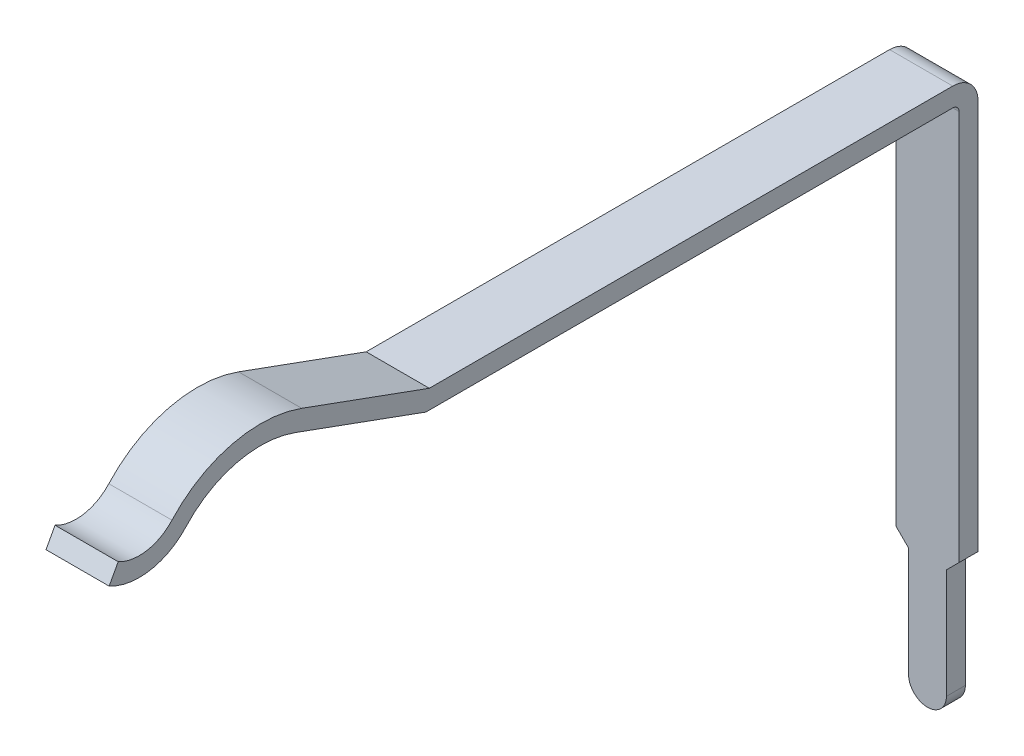
ISO-10303-21;
HEADER;
FILE_DESCRIPTION(('STEP AP214'),'2;1');
FILE_NAME('part.step','',(''),(''),'','','');
FILE_SCHEMA(('AUTOMOTIVE_DESIGN { 1 0 10303 214 1 1 1 1 }'));
ENDSEC;
DATA;
#1=APPLICATION_CONTEXT('core data for automotive mechanical design processes');
#2=APPLICATION_PROTOCOL_DEFINITION('international standard','automotive_design',2000,#1);
#3=PRODUCT_CONTEXT('',#1,'mechanical');
#4=PRODUCT('Part','Part','',(#3));
#5=PRODUCT_RELATED_PRODUCT_CATEGORY('part','',(#4));
#6=PRODUCT_DEFINITION_FORMATION('','',#4);
#7=PRODUCT_DEFINITION_CONTEXT('part definition',#1,'design');
#8=PRODUCT_DEFINITION('design','',#6,#7);
#9=PRODUCT_DEFINITION_SHAPE('','',#8);
#10=(LENGTH_UNIT() NAMED_UNIT(*) SI_UNIT(.MILLI.,.METRE.));
#11=(NAMED_UNIT(*) PLANE_ANGLE_UNIT() SI_UNIT($,.RADIAN.));
#12=(NAMED_UNIT(*) SI_UNIT($,.STERADIAN.) SOLID_ANGLE_UNIT());
#13=UNCERTAINTY_MEASURE_WITH_UNIT(LENGTH_MEASURE(1.E-05),#10,'distance_accuracy_value','');
#14=(GEOMETRIC_REPRESENTATION_CONTEXT(3) GLOBAL_UNCERTAINTY_ASSIGNED_CONTEXT((#13)) GLOBAL_UNIT_ASSIGNED_CONTEXT((#10,
#11,#12)) REPRESENTATION_CONTEXT('',''));
#15=CARTESIAN_POINT('',(0.,0.,0.));
#16=DIRECTION('',(0.,0.,1.));
#17=DIRECTION('',(1.,0.,0.));
#18=AXIS2_PLACEMENT_3D('',#15,#16,#17);
#19=CARTESIAN_POINT('',(0.5,-0.1,-14.36));
#20=DIRECTION('',(-1.,0.,0.));
#21=DIRECTION('',(0.,0.,1.));
#22=AXIS2_PLACEMENT_3D('',#19,#20,#21);
#23=CYLINDRICAL_SURFACE('',#22,0.399999999999999);
#24=DIRECTION('',(-1.,0.,0.));
#25=VECTOR('',#24,1.);
#26=CARTESIAN_POINT('',(0.,0.3,-14.36));
#27=LINE('',#26,#25);
#28=CARTESIAN_POINT('',(0.5,0.300000000311152,-14.36));
#29=VERTEX_POINT('',#28);
#30=CARTESIAN_POINT('',(-0.5,0.300000000311152,-14.36));
#31=VERTEX_POINT('',#30);
#32=EDGE_CURVE('E201',#29,#31,#27,.T.);
#33=ORIENTED_EDGE('',*,*,#32,.F.);
#34=CARTESIAN_POINT('',(0.5,-0.1,-14.36));
#35=DIRECTION('',(-1.,0.,0.));
#36=DIRECTION('',(0.,0.,1.));
#37=AXIS2_PLACEMENT_3D('',#34,#35,#36);
#38=CIRCLE('',#37,0.399999999999999);
#39=CARTESIAN_POINT('',(0.5,-0.1,-14.76));
#40=VERTEX_POINT('',#39);
#41=EDGE_CURVE('E238',#40,#29,#38,.F.);
#42=ORIENTED_EDGE('',*,*,#41,.F.);
#43=DIRECTION('',(1.,0.,0.));
#44=VECTOR('',#43,1.);
#45=CARTESIAN_POINT('',(0.,-0.1,-14.76));
#46=LINE('',#45,#44);
#47=CARTESIAN_POINT('',(-0.5,-0.1,-14.76));
#48=VERTEX_POINT('',#47);
#49=EDGE_CURVE('E152',#48,#40,#46,.T.);
#50=ORIENTED_EDGE('',*,*,#49,.F.);
#51=CARTESIAN_POINT('',(-0.5,-0.1,-14.36));
#52=DIRECTION('',(-1.,0.,0.));
#53=DIRECTION('',(0.,0.,1.));
#54=AXIS2_PLACEMENT_3D('',#51,#52,#53);
#55=CIRCLE('',#54,0.399999999999999);
#56=EDGE_CURVE('E206',#48,#31,#55,.F.);
#57=ORIENTED_EDGE('',*,*,#56,.T.);
#58=EDGE_LOOP('',(#33,#42,#50,#57));
#59=FACE_BOUND('',#58,.T.);
#60=ADVANCED_FACE('F17',(#59),#23,.T.);
#61=CARTESIAN_POINT('',(-0.5,0.3,-14.36));
#62=DIRECTION('',(0.,1.,0.));
#63=DIRECTION('',(0.,0.,1.));
#64=AXIS2_PLACEMENT_3D('',#61,#62,#63);
#65=PLANE('',#64);
#66=DIRECTION('',(0.,0.,1.));
#67=VECTOR('',#66,1.);
#68=CARTESIAN_POINT('',(0.5,0.300000000622303,-7.83872));
#69=LINE('',#68,#67);
#70=CARTESIAN_POINT('',(0.5,0.300000000466727,-6.07037707311936));
#71=VERTEX_POINT('',#70);
#72=EDGE_CURVE('E237',#29,#71,#69,.T.);
#73=ORIENTED_EDGE('',*,*,#72,.F.);
#74=ORIENTED_EDGE('',*,*,#32,.T.);
#75=DIRECTION('',(0.,0.,1.));
#76=VECTOR('',#75,1.);
#77=CARTESIAN_POINT('',(-0.5,0.300000000622303,-7.83872));
#78=LINE('',#77,#76);
#79=CARTESIAN_POINT('',(-0.5,0.300000000311152,-6.07037706914512));
#80=VERTEX_POINT('',#79);
#81=EDGE_CURVE('E263',#31,#80,#78,.T.);
#82=ORIENTED_EDGE('',*,*,#81,.T.);
#83=DIRECTION('',(-1.,0.,0.));
#84=VECTOR('',#83,1.);
#85=CARTESIAN_POINT('',(0.,0.3,-6.07037707));
#86=LINE('',#85,#84);
#87=EDGE_CURVE('E199',#71,#80,#86,.T.);
#88=ORIENTED_EDGE('',*,*,#87,.F.);
#89=EDGE_LOOP('',(#73,#74,#82,#88));
#90=FACE_BOUND('',#89,.T.);
#91=ADVANCED_FACE('F368',(#90),#65,.T.);
#92=CARTESIAN_POINT('',(-0.5,0.3,-6.07037707));
#93=DIRECTION('',(0.,0.939692620883365,-0.342020143057909));
#94=DIRECTION('',(0.,0.342020143057909,0.939692620883365));
#95=AXIS2_PLACEMENT_3D('',#92,#93,#94);
#96=PLANE('',#95);
#97=DIRECTION('',(0.,0.342020140746785,0.939692621724545));
#98=VECTOR('',#97,1.);
#99=CARTESIAN_POINT('',(0.5,0.300000000622303,-6.07037707623872));
#100=LINE('',#99,#98);
#101=CARTESIAN_POINT('',(0.5,1.03541597897149,-4.04983826915849));
#102=VERTEX_POINT('',#101);
#103=EDGE_CURVE('E235',#71,#102,#100,.T.);
#104=ORIENTED_EDGE('',*,*,#103,.F.);
#105=ORIENTED_EDGE('',*,*,#87,.T.);
#106=DIRECTION('',(0.,0.342020143057909,0.939692620883365));
#107=VECTOR('',#106,1.);
#108=CARTESIAN_POINT('',(-0.5,0.3,-6.07037707));
#109=LINE('',#108,#107);
#110=CARTESIAN_POINT('',(-0.5,1.03541597937978,-4.04983827179352));
#111=VERTEX_POINT('',#110);
#112=EDGE_CURVE('E261',#80,#111,#109,.T.);
#113=ORIENTED_EDGE('',*,*,#112,.T.);
#114=DIRECTION('',(-1.,0.,0.));
#115=VECTOR('',#114,1.);
#116=CARTESIAN_POINT('',(0.,1.03541597961914,-4.04983827197282));
#117=LINE('',#116,#115);
#118=EDGE_CURVE('E196',#111,#102,#117,.F.);
#119=ORIENTED_EDGE('',*,*,#118,.T.);
#120=EDGE_LOOP('',(#104,#105,#113,#119));
#121=FACE_BOUND('',#120,.T.);
#122=ADVANCED_FACE('F364',(#121),#96,.T.);
#123=CARTESIAN_POINT('',(0.5,-0.75,-3.4));
#124=DIRECTION('',(-1.,0.,0.));
#125=DIRECTION('',(0.,0.,1.));
#126=AXIS2_PLACEMENT_3D('',#123,#124,#125);
#127=CYLINDRICAL_SURFACE('',#126,1.9);
#128=DIRECTION('',(1.,0.,0.));
#129=VECTOR('',#128,1.);
#130=CARTESIAN_POINT('',(0.,0.52884615384742,-1.99481228515964));
#131=LINE('',#130,#129);
#132=CARTESIAN_POINT('',(0.5,0.528846153901887,-1.99481228505774));
#133=VERTEX_POINT('',#132);
#134=CARTESIAN_POINT('',(-0.5,0.528846153826487,-1.99481228514059));
#135=VERTEX_POINT('',#134);
#136=EDGE_CURVE('E194',#133,#135,#131,.F.);
#137=ORIENTED_EDGE('',*,*,#136,.F.);
#138=CARTESIAN_POINT('',(0.5,-0.75,-3.4));
#139=DIRECTION('',(-1.,0.,0.));
#140=DIRECTION('',(0.,0.,1.));
#141=AXIS2_PLACEMENT_3D('',#138,#139,#140);
#142=CIRCLE('',#141,1.9);
#143=EDGE_CURVE('E233',#102,#133,#142,.F.);
#144=ORIENTED_EDGE('',*,*,#143,.F.);
#145=ORIENTED_EDGE('',*,*,#118,.F.);
#146=CARTESIAN_POINT('',(-0.5,-0.75,-3.4));
#147=DIRECTION('',(-1.,0.,0.));
#148=DIRECTION('',(0.,0.,1.));
#149=AXIS2_PLACEMENT_3D('',#146,#147,#148);
#150=CIRCLE('',#149,1.9);
#151=EDGE_CURVE('E258',#111,#135,#150,.F.);
#152=ORIENTED_EDGE('',*,*,#151,.T.);
#153=EDGE_LOOP('',(#137,#144,#145,#152));
#154=FACE_BOUND('',#153,.T.);
#155=ADVANCED_FACE('F367',(#154),#127,.T.);
#156=CARTESIAN_POINT('',(0.5,1.,-1.477111548));
#157=DIRECTION('',(-1.,0.,0.));
#158=DIRECTION('',(0.,0.,1.));
#159=AXIS2_PLACEMENT_3D('',#156,#157,#158);
#160=CYLINDRICAL_SURFACE('',#159,0.7);
#161=CARTESIAN_POINT('',(0.5,1.,-1.477111548));
#162=DIRECTION('',(-1.,0.,0.));
#163=DIRECTION('',(0.,0.,1.));
#164=AXIS2_PLACEMENT_3D('',#161,#162,#163);
#165=CIRCLE('',#164,0.7);
#166=CARTESIAN_POINT('',(0.5,0.38481007960968,-1.14313346157592));
#167=VERTEX_POINT('',#166);
#168=EDGE_CURVE('E231',#133,#167,#165,.T.);
#169=ORIENTED_EDGE('',*,*,#168,.F.);
#170=ORIENTED_EDGE('',*,*,#136,.T.);
#171=CARTESIAN_POINT('',(-0.5,1.,-1.477111548));
#172=DIRECTION('',(-1.,0.,0.));
#173=DIRECTION('',(0.,0.,1.));
#174=AXIS2_PLACEMENT_3D('',#171,#172,#173);
#175=CIRCLE('',#174,0.7);
#176=CARTESIAN_POINT('',(-0.5,0.384810078226828,-1.14313346412314));
#177=VERTEX_POINT('',#176);
#178=EDGE_CURVE('E255',#135,#177,#175,.T.);
#179=ORIENTED_EDGE('',*,*,#178,.T.);
#180=DIRECTION('',(-1.,0.,0.));
#181=VECTOR('',#180,1.);
#182=CARTESIAN_POINT('',(0.,0.384810078,-1.143133464));
#183=LINE('',#182,#181);
#184=EDGE_CURVE('E192',#167,#177,#183,.T.);
#185=ORIENTED_EDGE('',*,*,#184,.F.);
#186=EDGE_LOOP('',(#169,#170,#179,#185));
#187=FACE_BOUND('',#186,.T.);
#188=ADVANCED_FACE('F362',(#187),#160,.F.);
#189=CARTESIAN_POINT('',(-0.5,0.384810078,-1.143133464));
#190=DIRECTION('',(0.,0.477111547746772,0.878842745322893));
#191=DIRECTION('',(0.,-0.878842745322893,0.477111547746772));
#192=AXIS2_PLACEMENT_3D('',#189,#190,#191);
#193=PLANE('',#192);
#194=DIRECTION('',(0.,-0.878842757719991,0.477111524911232));
#195=VECTOR('',#194,1.);
#196=CARTESIAN_POINT('',(0.5,0.384810080288333,-1.1431334586464));
#197=LINE('',#196,#195);
#198=CARTESIAN_POINT('',(0.5,0.121157254244879,-1.00000000104939));
#199=VERTEX_POINT('',#198);
#200=EDGE_CURVE('E229',#167,#199,#197,.T.);
#201=ORIENTED_EDGE('',*,*,#200,.F.);
#202=ORIENTED_EDGE('',*,*,#184,.T.);
#203=DIRECTION('',(0.,-0.878842745322893,0.477111547746772));
#204=VECTOR('',#203,1.);
#205=CARTESIAN_POINT('',(-0.5,0.384810078,-1.143133464));
#206=LINE('',#205,#204);
#207=CARTESIAN_POINT('',(-0.5,0.121157254721593,-1.00000000017128));
#208=VERTEX_POINT('',#207);
#209=EDGE_CURVE('E252',#177,#208,#206,.T.);
#210=ORIENTED_EDGE('',*,*,#209,.T.);
#211=DIRECTION('',(-1.,0.,0.));
#212=VECTOR('',#211,1.);
#213=CARTESIAN_POINT('',(0.,0.121157254586397,-1.00000000042032));
#214=LINE('',#213,#212);
#215=EDGE_CURVE('E189',#208,#199,#214,.F.);
#216=ORIENTED_EDGE('',*,*,#215,.T.);
#217=EDGE_LOOP('',(#201,#202,#210,#216));
#218=FACE_BOUND('',#217,.T.);
#219=ADVANCED_FACE('F358',(#218),#193,.T.);
#220=CARTESIAN_POINT('',(0.5,1.,-1.477111548));
#221=DIRECTION('',(-1.,0.,0.));
#222=DIRECTION('',(0.,0.,1.));
#223=AXIS2_PLACEMENT_3D('',#220,#221,#222);
#224=CYLINDRICAL_SURFACE('',#223,1.);
#225=DIRECTION('',(1.,0.,0.));
#226=VECTOR('',#225,1.);
#227=CARTESIAN_POINT('',(0.,0.326923076434778,-2.21668402890764));
#228=LINE('',#227,#226);
#229=CARTESIAN_POINT('',(0.5,0.326923076649927,-2.21668402925492));
#230=VERTEX_POINT('',#229);
#231=CARTESIAN_POINT('',(-0.5,0.326923076725328,-2.21668402917207));
#232=VERTEX_POINT('',#231);
#233=EDGE_CURVE('E187',#230,#232,#228,.F.);
#234=ORIENTED_EDGE('',*,*,#233,.F.);
#235=CARTESIAN_POINT('',(0.5,1.,-1.477111548));
#236=DIRECTION('',(-1.,0.,0.));
#237=DIRECTION('',(0.,0.,1.));
#238=AXIS2_PLACEMENT_3D('',#235,#236,#237);
#239=CIRCLE('',#238,1.);
#240=EDGE_CURVE('E227',#199,#230,#239,.F.);
#241=ORIENTED_EDGE('',*,*,#240,.F.);
#242=ORIENTED_EDGE('',*,*,#215,.F.);
#243=CARTESIAN_POINT('',(-0.5,1.,-1.477111548));
#244=DIRECTION('',(-1.,0.,0.));
#245=DIRECTION('',(0.,0.,1.));
#246=AXIS2_PLACEMENT_3D('',#243,#244,#245);
#247=CIRCLE('',#246,1.);
#248=EDGE_CURVE('E249',#208,#232,#247,.F.);
#249=ORIENTED_EDGE('',*,*,#248,.T.);
#250=EDGE_LOOP('',(#234,#241,#242,#249));
#251=FACE_BOUND('',#250,.T.);
#252=ADVANCED_FACE('F361',(#251),#224,.T.);
#253=CARTESIAN_POINT('',(0.5,-0.75,-3.4));
#254=DIRECTION('',(-1.,0.,0.));
#255=DIRECTION('',(0.,0.,1.));
#256=AXIS2_PLACEMENT_3D('',#253,#254,#255);
#257=CYLINDRICAL_SURFACE('',#256,1.6);
#258=CARTESIAN_POINT('',(0.5,-0.75,-3.4));
#259=DIRECTION('',(-1.,0.,0.));
#260=DIRECTION('',(0.,0.,1.));
#261=AXIS2_PLACEMENT_3D('',#258,#259,#260);
#262=CIRCLE('',#261,1.6);
#263=CARTESIAN_POINT('',(0.5,0.753508193627589,-3.94723223066755));
#264=VERTEX_POINT('',#263);
#265=EDGE_CURVE('E225',#230,#264,#262,.T.);
#266=ORIENTED_EDGE('',*,*,#265,.F.);
#267=ORIENTED_EDGE('',*,*,#233,.T.);
#268=CARTESIAN_POINT('',(-0.5,-0.75,-3.4));
#269=DIRECTION('',(-1.,0.,0.));
#270=DIRECTION('',(0.,0.,1.));
#271=AXIS2_PLACEMENT_3D('',#268,#269,#270);
#272=CIRCLE('',#271,1.6);
#273=CARTESIAN_POINT('',(-0.5,0.753508193021166,-3.94723222894185));
#274=VERTEX_POINT('',#273);
#275=EDGE_CURVE('E246',#232,#274,#272,.T.);
#276=ORIENTED_EDGE('',*,*,#275,.T.);
#277=DIRECTION('',(1.,0.,0.));
#278=VECTOR('',#277,1.);
#279=CARTESIAN_POINT('',(0.,0.753508193,-3.947232229));
#280=LINE('',#279,#278);
#281=EDGE_CURVE('E184',#274,#264,#280,.T.);
#282=ORIENTED_EDGE('',*,*,#281,.T.);
#283=EDGE_LOOP('',(#266,#267,#276,#282));
#284=FACE_BOUND('',#283,.T.);
#285=ADVANCED_FACE('F356',(#284),#257,.F.);
#286=CARTESIAN_POINT('',(-0.5,0.,-6.017478976));
#287=DIRECTION('',(0.,0.939692620858037,-0.342020143127497));
#288=DIRECTION('',(0.,0.342020143127497,0.939692620858037));
#289=AXIS2_PLACEMENT_3D('',#286,#287,#288);
#290=PLANE('',#289);
#291=DIRECTION('',(1.,0.,0.));
#292=VECTOR('',#291,1.);
#293=CARTESIAN_POINT('',(0.,0.,-6.017478976));
#294=LINE('',#293,#292);
#295=CARTESIAN_POINT('',(-0.5,-1.3890104451685E-09,-6.01747897981627));
#296=VERTEX_POINT('',#295);
#297=CARTESIAN_POINT('',(0.5,-1.75888896004374E-09,-6.01747897737994));
#298=VERTEX_POINT('',#297);
#299=EDGE_CURVE('E181',#296,#298,#294,.T.);
#300=ORIENTED_EDGE('',*,*,#299,.T.);
#301=DIRECTION('',(0.,-0.342020144788669,-0.93969262025342));
#302=VECTOR('',#301,1.);
#303=CARTESIAN_POINT('',(0.5,0.753508195005623,-3.94723223027328));
#304=LINE('',#303,#302);
#305=EDGE_CURVE('E223',#264,#298,#304,.T.);
#306=ORIENTED_EDGE('',*,*,#305,.F.);
#307=ORIENTED_EDGE('',*,*,#281,.F.);
#308=DIRECTION('',(0.,0.342020143127497,0.939692620858037));
#309=VECTOR('',#308,1.);
#310=CARTESIAN_POINT('',(-0.5,0.,-6.017478976));
#311=LINE('',#310,#309);
#312=EDGE_CURVE('E242',#274,#296,#311,.F.);
#313=ORIENTED_EDGE('',*,*,#312,.T.);
#314=EDGE_LOOP('',(#300,#306,#307,#313));
#315=FACE_BOUND('',#314,.T.);
#316=ADVANCED_FACE('F353',(#315),#290,.F.);
#317=CARTESIAN_POINT('',(-0.5,0.,-14.36));
#318=DIRECTION('',(0.,1.,0.));
#319=DIRECTION('',(0.,0.,1.));
#320=AXIS2_PLACEMENT_3D('',#317,#318,#319);
#321=PLANE('',#320);
#322=DIRECTION('',(1.,0.,0.));
#323=VECTOR('',#322,1.);
#324=CARTESIAN_POINT('',(0.,0.,-14.3600000000205));
#325=LINE('',#324,#323);
#326=CARTESIAN_POINT('',(0.5,-1.38901065128982E-09,-14.3600000000103));
#327=VERTEX_POINT('',#326);
#328=CARTESIAN_POINT('',(-0.5,-1.38901065128982E-09,-14.3600000000103));
#329=VERTEX_POINT('',#328);
#330=EDGE_CURVE('E176',#327,#329,#325,.F.);
#331=ORIENTED_EDGE('',*,*,#330,.F.);
#332=DIRECTION('',(0.,0.,-1.));
#333=VECTOR('',#332,1.);
#334=CARTESIAN_POINT('',(0.5,-2.77802130257965E-09,-7.83872));
#335=LINE('',#334,#333);
#336=EDGE_CURVE('E222',#298,#327,#335,.T.);
#337=ORIENTED_EDGE('',*,*,#336,.F.);
#338=ORIENTED_EDGE('',*,*,#299,.F.);
#339=DIRECTION('',(0.,0.,-1.));
#340=VECTOR('',#339,1.);
#341=CARTESIAN_POINT('',(-0.5,-2.77802130257965E-09,-7.83872));
#342=LINE('',#341,#340);
#343=EDGE_CURVE('E245',#296,#329,#342,.T.);
#344=ORIENTED_EDGE('',*,*,#343,.T.);
#345=EDGE_LOOP('',(#331,#337,#338,#344));
#346=FACE_BOUND('',#345,.T.);
#347=ADVANCED_FACE('F286',(#346),#321,.F.);
#348=CARTESIAN_POINT('',(0.5,-8.57052,-14.76));
#349=DIRECTION('',(0.,0.,-1.));
#350=DIRECTION('',(-1.,0.,0.));
#351=AXIS2_PLACEMENT_3D('',#348,#349,#350);
#352=PLANE('',#351);
#353=ORIENTED_EDGE('',*,*,#49,.T.);
#354=DIRECTION('',(0.,1.,0.));
#355=VECTOR('',#354,1.);
#356=CARTESIAN_POINT('',(0.5,-2.5453267095,-14.76));
#357=LINE('',#356,#355);
#358=CARTESIAN_POINT('',(0.5,-6.285265009,-14.76));
#359=VERTEX_POINT('',#358);
#360=EDGE_CURVE('E179',#359,#40,#357,.T.);
#361=ORIENTED_EDGE('',*,*,#360,.F.);
#362=DIRECTION('',(-0.707106781186547,-0.707106781186548,0.));
#363=VECTOR('',#362,1.);
#364=CARTESIAN_POINT('',(0.4,-6.385265009,-14.76));
#365=LINE('',#364,#363);
#366=CARTESIAN_POINT('',(0.3,-6.485265009,-14.76));
#367=VERTEX_POINT('',#366);
#368=EDGE_CURVE('E141',#359,#367,#365,.T.);
#369=ORIENTED_EDGE('',*,*,#368,.T.);
#370=DIRECTION('',(0.,-1.,0.));
#371=VECTOR('',#370,1.);
#372=CARTESIAN_POINT('',(0.3,-7.3526325045,-14.76));
#373=LINE('',#372,#371);
#374=CARTESIAN_POINT('',(0.3,-8.22,-14.76));
#375=VERTEX_POINT('',#374);
#376=EDGE_CURVE('E150',#367,#375,#373,.T.);
#377=ORIENTED_EDGE('',*,*,#376,.T.);
#378=CARTESIAN_POINT('',(0.,-8.22,-14.76));
#379=DIRECTION('',(0.,0.,1.));
#380=DIRECTION('',(0.,-1.,0.));
#381=AXIS2_PLACEMENT_3D('',#378,#379,#380);
#382=CIRCLE('',#381,0.3);
#383=CARTESIAN_POINT('',(-0.3,-8.22,-14.76));
#384=VERTEX_POINT('',#383);
#385=EDGE_CURVE('E21',#375,#384,#382,.F.);
#386=ORIENTED_EDGE('',*,*,#385,.T.);
#387=DIRECTION('',(0.,1.,0.));
#388=VECTOR('',#387,1.);
#389=CARTESIAN_POINT('',(-0.3,-7.3526325045,-14.76));
#390=LINE('',#389,#388);
#391=CARTESIAN_POINT('',(-0.3,-6.485265009,-14.76));
#392=VERTEX_POINT('',#391);
#393=EDGE_CURVE('E147',#384,#392,#390,.T.);
#394=ORIENTED_EDGE('',*,*,#393,.T.);
#395=DIRECTION('',(-0.707106781186547,0.707106781186548,0.));
#396=VECTOR('',#395,1.);
#397=CARTESIAN_POINT('',(-0.4,-6.385265009,-14.76));
#398=LINE('',#397,#396);
#399=CARTESIAN_POINT('',(-0.5,-6.285265009,-14.76));
#400=VERTEX_POINT('',#399);
#401=EDGE_CURVE('E204',#392,#400,#398,.T.);
#402=ORIENTED_EDGE('',*,*,#401,.T.);
#403=DIRECTION('',(0.,1.,0.));
#404=VECTOR('',#403,1.);
#405=CARTESIAN_POINT('',(-0.5,-2.5453267095,-14.76));
#406=LINE('',#405,#404);
#407=EDGE_CURVE('E241',#400,#48,#406,.T.);
#408=ORIENTED_EDGE('',*,*,#407,.T.);
#409=EDGE_LOOP('',(#353,#361,#369,#377,#386,#394,#402,#408));
#410=FACE_BOUND('',#409,.T.);
#411=ADVANCED_FACE('F149',(#410),#352,.T.);
#412=CARTESIAN_POINT('',(0.,-8.22,-14.76));
#413=DIRECTION('',(0.,0.,1.));
#414=DIRECTION('',(0.,-1.,0.));
#415=AXIS2_PLACEMENT_3D('',#412,#413,#414);
#416=CYLINDRICAL_SURFACE('',#415,0.3);
#417=ORIENTED_EDGE('',*,*,#385,.F.);
#418=DIRECTION('',(0.,0.,1.));
#419=VECTOR('',#418,1.);
#420=CARTESIAN_POINT('',(0.3,-8.22,-14.61));
#421=LINE('',#420,#419);
#422=CARTESIAN_POINT('',(0.3,-8.22,-14.46));
#423=VERTEX_POINT('',#422);
#424=EDGE_CURVE('E169',#375,#423,#421,.T.);
#425=ORIENTED_EDGE('',*,*,#424,.T.);
#426=CARTESIAN_POINT('',(0.,-8.22,-14.46));
#427=DIRECTION('',(0.,0.,1.));
#428=DIRECTION('',(0.,-1.,0.));
#429=AXIS2_PLACEMENT_3D('',#426,#427,#428);
#430=CIRCLE('',#429,0.3);
#431=CARTESIAN_POINT('',(-0.3,-8.22,-14.46));
#432=VERTEX_POINT('',#431);
#433=EDGE_CURVE('E162',#423,#432,#430,.F.);
#434=ORIENTED_EDGE('',*,*,#433,.T.);
#435=DIRECTION('',(0.,0.,-1.));
#436=VECTOR('',#435,1.);
#437=CARTESIAN_POINT('',(-0.3,-8.22,-14.61));
#438=LINE('',#437,#436);
#439=EDGE_CURVE('E151',#432,#384,#438,.T.);
#440=ORIENTED_EDGE('',*,*,#439,.T.);
#441=EDGE_LOOP('',(#417,#425,#434,#440));
#442=FACE_BOUND('',#441,.T.);
#443=ADVANCED_FACE('F161',(#442),#416,.T.);
#444=CARTESIAN_POINT('',(-0.3,-8.22,-14.46));
#445=DIRECTION('',(1.,0.,0.));
#446=DIRECTION('',(0.,0.,-1.));
#447=AXIS2_PLACEMENT_3D('',#444,#445,#446);
#448=PLANE('',#447);
#449=ORIENTED_EDGE('',*,*,#393,.F.);
#450=ORIENTED_EDGE('',*,*,#439,.F.);
#451=DIRECTION('',(0.,1.,0.));
#452=VECTOR('',#451,1.);
#453=CARTESIAN_POINT('',(-0.3,-4.33526,-14.46));
#454=LINE('',#453,#452);
#455=CARTESIAN_POINT('',(-0.3,-6.485265009,-14.46));
#456=VERTEX_POINT('',#455);
#457=EDGE_CURVE('E218',#432,#456,#454,.T.);
#458=ORIENTED_EDGE('',*,*,#457,.T.);
#459=DIRECTION('',(0.,0.,-1.));
#460=VECTOR('',#459,1.);
#461=CARTESIAN_POINT('',(-0.3,-6.485265009,-14.61));
#462=LINE('',#461,#460);
#463=EDGE_CURVE('E158',#456,#392,#462,.T.);
#464=ORIENTED_EDGE('',*,*,#463,.T.);
#465=EDGE_LOOP('',(#449,#450,#458,#464));
#466=FACE_BOUND('',#465,.T.);
#467=ADVANCED_FACE('F155',(#466),#448,.F.);
#468=CARTESIAN_POINT('',(-0.3,-6.485265009,-14.76));
#469=DIRECTION('',(0.707106781186548,0.707106781186547,0.));
#470=DIRECTION('',(-0.707106781186547,0.707106781186548,0.));
#471=AXIS2_PLACEMENT_3D('',#468,#469,#470);
#472=PLANE('',#471);
#473=ORIENTED_EDGE('',*,*,#401,.F.);
#474=ORIENTED_EDGE('',*,*,#463,.F.);
#475=DIRECTION('',(-0.707106781186547,0.707106781186548,0.));
#476=VECTOR('',#475,1.);
#477=CARTESIAN_POINT('',(-0.3,-6.485265009,-14.46));
#478=LINE('',#477,#476);
#479=CARTESIAN_POINT('',(-0.5,-6.285265009,-14.46));
#480=VERTEX_POINT('',#479);
#481=EDGE_CURVE('E214',#456,#480,#478,.T.);
#482=ORIENTED_EDGE('',*,*,#481,.T.);
#483=DIRECTION('',(0.,0.,-1.));
#484=VECTOR('',#483,1.);
#485=CARTESIAN_POINT('',(-0.5,-6.285265009,-7.83872));
#486=LINE('',#485,#484);
#487=EDGE_CURVE('E276',#480,#400,#486,.T.);
#488=ORIENTED_EDGE('',*,*,#487,.T.);
#489=EDGE_LOOP('',(#473,#474,#482,#488));
#490=FACE_BOUND('',#489,.T.);
#491=ADVANCED_FACE('F324',(#490),#472,.F.);
#492=CARTESIAN_POINT('',(-0.5,-6.285265009,-0.91744));
#493=DIRECTION('',(1.,0.,0.));
#494=DIRECTION('',(0.,0.,-1.));
#495=AXIS2_PLACEMENT_3D('',#492,#493,#494);
#496=PLANE('',#495);
#497=ORIENTED_EDGE('',*,*,#487,.F.);
#498=DIRECTION('',(0.,1.,0.));
#499=VECTOR('',#498,1.);
#500=CARTESIAN_POINT('',(-0.5,-4.33526,-14.46));
#501=LINE('',#500,#499);
#502=CARTESIAN_POINT('',(-0.5,-0.1,-14.46));
#503=VERTEX_POINT('',#502);
#504=EDGE_CURVE('E217',#480,#503,#501,.T.);
#505=ORIENTED_EDGE('',*,*,#504,.T.);
#506=CARTESIAN_POINT('',(-0.5,-0.1,-14.36));
#507=DIRECTION('',(-1.,0.,0.));
#508=DIRECTION('',(0.,0.,1.));
#509=AXIS2_PLACEMENT_3D('',#506,#507,#508);
#510=CIRCLE('',#509,0.100000000000001);
#511=EDGE_CURVE('E180',#329,#503,#510,.T.);
#512=ORIENTED_EDGE('',*,*,#511,.F.);
#513=ORIENTED_EDGE('',*,*,#343,.F.);
#514=ORIENTED_EDGE('',*,*,#312,.F.);
#515=ORIENTED_EDGE('',*,*,#275,.F.);
#516=ORIENTED_EDGE('',*,*,#248,.F.);
#517=ORIENTED_EDGE('',*,*,#209,.F.);
#518=ORIENTED_EDGE('',*,*,#178,.F.);
#519=ORIENTED_EDGE('',*,*,#151,.F.);
#520=ORIENTED_EDGE('',*,*,#112,.F.);
#521=ORIENTED_EDGE('',*,*,#81,.F.);
#522=ORIENTED_EDGE('',*,*,#56,.F.);
#523=ORIENTED_EDGE('',*,*,#407,.F.);
#524=EDGE_LOOP('',(#497,#505,#512,#513,#514,#515,#516,#517,#518,#519,#520,#521,#522,#523));
#525=FACE_BOUND('',#524,.T.);
#526=ADVANCED_FACE('F297',(#525),#496,.F.);
#527=CARTESIAN_POINT('',(0.5,-0.1,-14.36));
#528=DIRECTION('',(-1.,0.,0.));
#529=DIRECTION('',(0.,0.,1.));
#530=AXIS2_PLACEMENT_3D('',#527,#528,#529);
#531=CYLINDRICAL_SURFACE('',#530,0.100000000000001);
#532=CARTESIAN_POINT('',(0.5,-0.1,-14.36));
#533=DIRECTION('',(-1.,0.,0.));
#534=DIRECTION('',(0.,0.,1.));
#535=AXIS2_PLACEMENT_3D('',#532,#533,#534);
#536=CIRCLE('',#535,0.100000000000001);
#537=CARTESIAN_POINT('',(0.5,-0.1,-14.46));
#538=VERTEX_POINT('',#537);
#539=EDGE_CURVE('E220',#327,#538,#536,.T.);
#540=ORIENTED_EDGE('',*,*,#539,.F.);
#541=ORIENTED_EDGE('',*,*,#330,.T.);
#542=ORIENTED_EDGE('',*,*,#511,.T.);
#543=DIRECTION('',(1.,0.,0.));
#544=VECTOR('',#543,1.);
#545=CARTESIAN_POINT('',(0.,-0.1,-14.46));
#546=LINE('',#545,#544);
#547=EDGE_CURVE('E302',#503,#538,#546,.T.);
#548=ORIENTED_EDGE('',*,*,#547,.T.);
#549=EDGE_LOOP('',(#540,#541,#542,#548));
#550=FACE_BOUND('',#549,.T.);
#551=ADVANCED_FACE('F293',(#550),#531,.F.);
#552=CARTESIAN_POINT('',(0.5,-6.285265009,-0.91744));
#553=DIRECTION('',(1.,0.,0.));
#554=DIRECTION('',(0.,0.,-1.));
#555=AXIS2_PLACEMENT_3D('',#552,#553,#554);
#556=PLANE('',#555);
#557=ORIENTED_EDGE('',*,*,#539,.T.);
#558=DIRECTION('',(0.,-1.,0.));
#559=VECTOR('',#558,1.);
#560=CARTESIAN_POINT('',(0.5,-4.33526,-14.46));
#561=LINE('',#560,#559);
#562=CARTESIAN_POINT('',(0.5,-6.285265009,-14.46));
#563=VERTEX_POINT('',#562);
#564=EDGE_CURVE('E213',#538,#563,#561,.T.);
#565=ORIENTED_EDGE('',*,*,#564,.T.);
#566=DIRECTION('',(0.,0.,-1.));
#567=VECTOR('',#566,1.);
#568=CARTESIAN_POINT('',(0.5,-6.285265009,-14.61));
#569=LINE('',#568,#567);
#570=EDGE_CURVE('E173',#563,#359,#569,.T.);
#571=ORIENTED_EDGE('',*,*,#570,.T.);
#572=ORIENTED_EDGE('',*,*,#360,.T.);
#573=ORIENTED_EDGE('',*,*,#41,.T.);
#574=ORIENTED_EDGE('',*,*,#72,.T.);
#575=ORIENTED_EDGE('',*,*,#103,.T.);
#576=ORIENTED_EDGE('',*,*,#143,.T.);
#577=ORIENTED_EDGE('',*,*,#168,.T.);
#578=ORIENTED_EDGE('',*,*,#200,.T.);
#579=ORIENTED_EDGE('',*,*,#240,.T.);
#580=ORIENTED_EDGE('',*,*,#265,.T.);
#581=ORIENTED_EDGE('',*,*,#305,.T.);
#582=ORIENTED_EDGE('',*,*,#336,.T.);
#583=EDGE_LOOP('',(#557,#565,#571,#572,#573,#574,#575,#576,#577,#578,#579,#580,#581,#582));
#584=FACE_BOUND('',#583,.T.);
#585=ADVANCED_FACE('F328',(#584),#556,.T.);
#586=CARTESIAN_POINT('',(0.5,-6.285265009,-14.76));
#587=DIRECTION('',(-0.707106781186548,0.707106781186547,0.));
#588=DIRECTION('',(-0.707106781186547,-0.707106781186548,0.));
#589=AXIS2_PLACEMENT_3D('',#586,#587,#588);
#590=PLANE('',#589);
#591=ORIENTED_EDGE('',*,*,#368,.F.);
#592=ORIENTED_EDGE('',*,*,#570,.F.);
#593=DIRECTION('',(-0.707106781186547,-0.707106781186548,0.));
#594=VECTOR('',#593,1.);
#595=CARTESIAN_POINT('',(0.5,-6.285265009,-14.46));
#596=LINE('',#595,#594);
#597=CARTESIAN_POINT('',(0.3,-6.485265009,-14.46));
#598=VERTEX_POINT('',#597);
#599=EDGE_CURVE('E27',#563,#598,#596,.T.);
#600=ORIENTED_EDGE('',*,*,#599,.T.);
#601=DIRECTION('',(0.,0.,-1.));
#602=VECTOR('',#601,1.);
#603=CARTESIAN_POINT('',(0.3,-6.485265009,-14.61));
#604=LINE('',#603,#602);
#605=EDGE_CURVE('E35',#598,#367,#604,.T.);
#606=ORIENTED_EDGE('',*,*,#605,.T.);
#607=EDGE_LOOP('',(#591,#592,#600,#606));
#608=FACE_BOUND('',#607,.T.);
#609=ADVANCED_FACE('F331',(#608),#590,.F.);
#610=CARTESIAN_POINT('',(0.3,-6.485265009,-14.76));
#611=DIRECTION('',(-1.,0.,0.));
#612=DIRECTION('',(0.,-1.,0.));
#613=AXIS2_PLACEMENT_3D('',#610,#611,#612);
#614=PLANE('',#613);
#615=ORIENTED_EDGE('',*,*,#376,.F.);
#616=ORIENTED_EDGE('',*,*,#605,.F.);
#617=DIRECTION('',(0.,-1.,0.));
#618=VECTOR('',#617,1.);
#619=CARTESIAN_POINT('',(0.3,-4.33526,-14.46));
#620=LINE('',#619,#618);
#621=EDGE_CURVE('E11',#598,#423,#620,.T.);
#622=ORIENTED_EDGE('',*,*,#621,.T.);
#623=ORIENTED_EDGE('',*,*,#424,.F.);
#624=EDGE_LOOP('',(#615,#616,#622,#623));
#625=FACE_BOUND('',#624,.T.);
#626=ADVANCED_FACE('F332',(#625),#614,.F.);
#627=CARTESIAN_POINT('',(0.5,-8.57052,-14.46));
#628=DIRECTION('',(0.,0.,-1.));
#629=DIRECTION('',(-1.,0.,0.));
#630=AXIS2_PLACEMENT_3D('',#627,#628,#629);
#631=PLANE('',#630);
#632=ORIENTED_EDGE('',*,*,#599,.F.);
#633=ORIENTED_EDGE('',*,*,#564,.F.);
#634=ORIENTED_EDGE('',*,*,#547,.F.);
#635=ORIENTED_EDGE('',*,*,#504,.F.);
#636=ORIENTED_EDGE('',*,*,#481,.F.);
#637=ORIENTED_EDGE('',*,*,#457,.F.);
#638=ORIENTED_EDGE('',*,*,#433,.F.);
#639=ORIENTED_EDGE('',*,*,#621,.F.);
#640=EDGE_LOOP('',(#632,#633,#634,#635,#636,#637,#638,#639));
#641=FACE_BOUND('',#640,.T.);
#642=ADVANCED_FACE('F19',(#641),#631,.F.);
#643=CLOSED_SHELL('',(#60,#91,#122,#155,#188,#219,#252,#285,#316,#347,#411,#443,#467,#491,#526,
#551,#585,#609,#626,#642));
#644=MANIFOLD_SOLID_BREP('B1',#643);
#645=ADVANCED_BREP_SHAPE_REPRESENTATION('',(#18,#644),#14);
#646=SHAPE_DEFINITION_REPRESENTATION(#9,#645);
ENDSEC;
END-ISO-10303-21;
